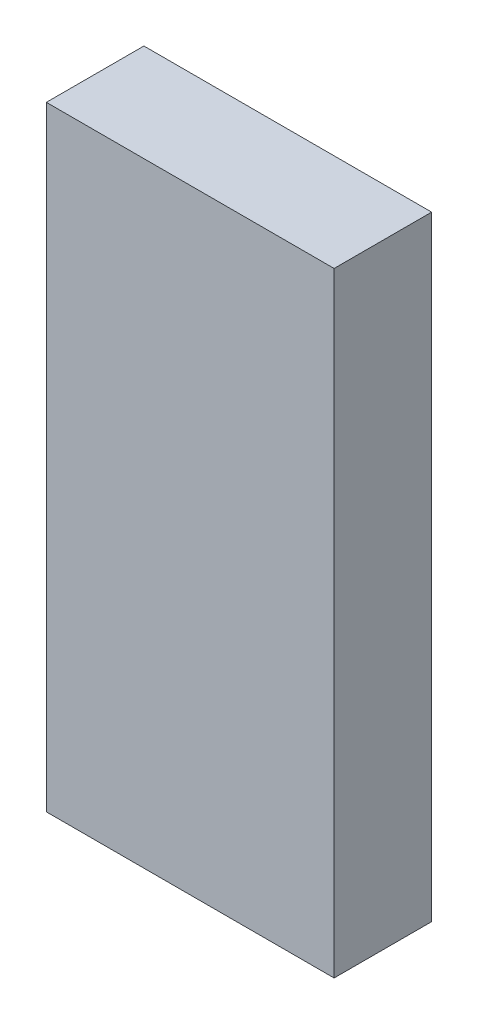
ISO-10303-21;
HEADER;
FILE_DESCRIPTION(('STEP AP214'),'2;1');
FILE_NAME('part.step','',(''),(''),'','','');
FILE_SCHEMA(('AUTOMOTIVE_DESIGN { 1 0 10303 214 1 1 1 1 }'));
ENDSEC;
DATA;
#1=APPLICATION_CONTEXT('core data for automotive mechanical design processes');
#2=APPLICATION_PROTOCOL_DEFINITION('international standard','automotive_design',2000,#1);
#3=PRODUCT_CONTEXT('',#1,'mechanical');
#4=PRODUCT('Part','Part','',(#3));
#5=PRODUCT_RELATED_PRODUCT_CATEGORY('part','',(#4));
#6=PRODUCT_DEFINITION_FORMATION('','',#4);
#7=PRODUCT_DEFINITION_CONTEXT('part definition',#1,'design');
#8=PRODUCT_DEFINITION('design','',#6,#7);
#9=PRODUCT_DEFINITION_SHAPE('','',#8);
#10=(LENGTH_UNIT() NAMED_UNIT(*) SI_UNIT(.MILLI.,.METRE.));
#11=(NAMED_UNIT(*) PLANE_ANGLE_UNIT() SI_UNIT($,.RADIAN.));
#12=(NAMED_UNIT(*) SI_UNIT($,.STERADIAN.) SOLID_ANGLE_UNIT());
#13=UNCERTAINTY_MEASURE_WITH_UNIT(LENGTH_MEASURE(1.E-05),#10,'distance_accuracy_value','');
#14=(GEOMETRIC_REPRESENTATION_CONTEXT(3) GLOBAL_UNCERTAINTY_ASSIGNED_CONTEXT((#13)) GLOBAL_UNIT_ASSIGNED_CONTEXT((#10,
#11,#12)) REPRESENTATION_CONTEXT('',''));
#15=CARTESIAN_POINT('',(0.,0.,0.));
#16=DIRECTION('',(0.,0.,1.));
#17=DIRECTION('',(1.,0.,0.));
#18=AXIS2_PLACEMENT_3D('',#15,#16,#17);
#19=CARTESIAN_POINT('',(2.95000172,-6.3000001,2.));
#20=DIRECTION('',(0.,0.,1.));
#21=DIRECTION('',(1.,0.,0.));
#22=AXIS2_PLACEMENT_3D('',#19,#20,#21);
#23=PLANE('',#22);
#24=DIRECTION('',(0.,1.,0.));
#25=VECTOR('',#24,1.);
#26=CARTESIAN_POINT('',(-2.94999918,-6.3000001,2.));
#27=LINE('',#26,#25);
#28=CARTESIAN_POINT('',(-2.94999918,-6.3000001,2.));
#29=VERTEX_POINT('',#28);
#30=CARTESIAN_POINT('',(-2.94999918,6.3000001,2.));
#31=VERTEX_POINT('',#30);
#32=EDGE_CURVE('E53',#29,#31,#27,.T.);
#33=ORIENTED_EDGE('',*,*,#32,.F.);
#34=DIRECTION('',(1.,0.,0.));
#35=VECTOR('',#34,1.);
#36=CARTESIAN_POINT('',(2.95000172,-6.3000001,2.));
#37=LINE('',#36,#35);
#38=CARTESIAN_POINT('',(2.95000172,-6.3000001,2.));
#39=VERTEX_POINT('',#38);
#40=EDGE_CURVE('E68',#39,#29,#37,.F.);
#41=ORIENTED_EDGE('',*,*,#40,.F.);
#42=DIRECTION('',(0.,1.,0.));
#43=VECTOR('',#42,1.);
#44=CARTESIAN_POINT('',(2.95000172,6.3000001,2.));
#45=LINE('',#44,#43);
#46=CARTESIAN_POINT('',(2.95000172,6.3000001,2.));
#47=VERTEX_POINT('',#46);
#48=EDGE_CURVE('E20',#47,#39,#45,.F.);
#49=ORIENTED_EDGE('',*,*,#48,.F.);
#50=DIRECTION('',(1.,0.,0.));
#51=VECTOR('',#50,1.);
#52=CARTESIAN_POINT('',(-2.94999918,6.3000001,2.));
#53=LINE('',#52,#51);
#54=EDGE_CURVE('E58',#31,#47,#53,.T.);
#55=ORIENTED_EDGE('',*,*,#54,.F.);
#56=EDGE_LOOP('',(#33,#41,#49,#55));
#57=FACE_BOUND('',#56,.T.);
#58=ADVANCED_FACE('F17',(#57),#23,.T.);
#59=CARTESIAN_POINT('',(2.95000172,6.3000001,0.));
#60=DIRECTION('',(1.,0.,0.));
#61=DIRECTION('',(0.,0.,-1.));
#62=AXIS2_PLACEMENT_3D('',#59,#60,#61);
#63=PLANE('',#62);
#64=DIRECTION('',(0.,0.,-1.));
#65=VECTOR('',#64,1.);
#66=CARTESIAN_POINT('',(2.95000172,-6.3000001,0.));
#67=LINE('',#66,#65);
#68=CARTESIAN_POINT('',(2.95000172,-6.3000001,0.));
#69=VERTEX_POINT('',#68);
#70=EDGE_CURVE('E79',#69,#39,#67,.F.);
#71=ORIENTED_EDGE('',*,*,#70,.F.);
#72=DIRECTION('',(0.,1.,0.));
#73=VECTOR('',#72,1.);
#74=CARTESIAN_POINT('',(2.95000172,-6.3000001,0.));
#75=LINE('',#74,#73);
#76=CARTESIAN_POINT('',(2.95000172,6.3000001,0.));
#77=VERTEX_POINT('',#76);
#78=EDGE_CURVE('E74',#69,#77,#75,.T.);
#79=ORIENTED_EDGE('',*,*,#78,.T.);
#80=DIRECTION('',(0.,0.,1.));
#81=VECTOR('',#80,1.);
#82=CARTESIAN_POINT('',(2.95000172,6.3000001,0.));
#83=LINE('',#82,#81);
#84=EDGE_CURVE('E63',#47,#77,#83,.F.);
#85=ORIENTED_EDGE('',*,*,#84,.F.);
#86=ORIENTED_EDGE('',*,*,#48,.T.);
#87=EDGE_LOOP('',(#71,#79,#85,#86));
#88=FACE_BOUND('',#87,.T.);
#89=ADVANCED_FACE('F73',(#88),#63,.T.);
#90=CARTESIAN_POINT('',(-2.94999918,6.3000001,0.));
#91=DIRECTION('',(0.,1.,0.));
#92=DIRECTION('',(0.,0.,1.));
#93=AXIS2_PLACEMENT_3D('',#90,#91,#92);
#94=PLANE('',#93);
#95=ORIENTED_EDGE('',*,*,#84,.T.);
#96=DIRECTION('',(1.,0.,0.));
#97=VECTOR('',#96,1.);
#98=CARTESIAN_POINT('',(2.95000172,6.3000001,0.));
#99=LINE('',#98,#97);
#100=CARTESIAN_POINT('',(-2.94999918,6.3000001,0.));
#101=VERTEX_POINT('',#100);
#102=EDGE_CURVE('E84',#77,#101,#99,.F.);
#103=ORIENTED_EDGE('',*,*,#102,.T.);
#104=DIRECTION('',(0.,0.,1.));
#105=VECTOR('',#104,1.);
#106=CARTESIAN_POINT('',(-2.94999918,6.3000001,0.));
#107=LINE('',#106,#105);
#108=EDGE_CURVE('E65',#31,#101,#107,.F.);
#109=ORIENTED_EDGE('',*,*,#108,.F.);
#110=ORIENTED_EDGE('',*,*,#54,.T.);
#111=EDGE_LOOP('',(#95,#103,#109,#110));
#112=FACE_BOUND('',#111,.T.);
#113=ADVANCED_FACE('F60',(#112),#94,.T.);
#114=CARTESIAN_POINT('',(-2.94999918,-6.3000001,0.));
#115=DIRECTION('',(-1.,0.,0.));
#116=DIRECTION('',(0.,0.,1.));
#117=AXIS2_PLACEMENT_3D('',#114,#115,#116);
#118=PLANE('',#117);
#119=ORIENTED_EDGE('',*,*,#108,.T.);
#120=DIRECTION('',(0.,1.,0.));
#121=VECTOR('',#120,1.);
#122=CARTESIAN_POINT('',(-2.94999918,-6.3000001,0.));
#123=LINE('',#122,#121);
#124=CARTESIAN_POINT('',(-2.94999918,-6.3000001,0.));
#125=VERTEX_POINT('',#124);
#126=EDGE_CURVE('E26',#101,#125,#123,.F.);
#127=ORIENTED_EDGE('',*,*,#126,.T.);
#128=DIRECTION('',(0.,0.,-1.));
#129=VECTOR('',#128,1.);
#130=CARTESIAN_POINT('',(-2.94999918,-6.3000001,0.));
#131=LINE('',#130,#129);
#132=EDGE_CURVE('E34',#29,#125,#131,.T.);
#133=ORIENTED_EDGE('',*,*,#132,.F.);
#134=ORIENTED_EDGE('',*,*,#32,.T.);
#135=EDGE_LOOP('',(#119,#127,#133,#134));
#136=FACE_BOUND('',#135,.T.);
#137=ADVANCED_FACE('F88',(#136),#118,.T.);
#138=CARTESIAN_POINT('',(2.95000172,-6.3000001,0.));
#139=DIRECTION('',(0.,-1.,0.));
#140=DIRECTION('',(0.,0.,-1.));
#141=AXIS2_PLACEMENT_3D('',#138,#139,#140);
#142=PLANE('',#141);
#143=ORIENTED_EDGE('',*,*,#132,.T.);
#144=DIRECTION('',(1.,0.,0.));
#145=VECTOR('',#144,1.);
#146=CARTESIAN_POINT('',(2.95000172,-6.3000001,0.));
#147=LINE('',#146,#145);
#148=EDGE_CURVE('E11',#125,#69,#147,.T.);
#149=ORIENTED_EDGE('',*,*,#148,.T.);
#150=ORIENTED_EDGE('',*,*,#70,.T.);
#151=ORIENTED_EDGE('',*,*,#40,.T.);
#152=EDGE_LOOP('',(#143,#149,#150,#151));
#153=FACE_BOUND('',#152,.T.);
#154=ADVANCED_FACE('F91',(#153),#142,.T.);
#155=CARTESIAN_POINT('',(2.95000172,-6.3000001,0.));
#156=DIRECTION('',(0.,0.,1.));
#157=DIRECTION('',(1.,0.,0.));
#158=AXIS2_PLACEMENT_3D('',#155,#156,#157);
#159=PLANE('',#158);
#160=ORIENTED_EDGE('',*,*,#126,.F.);
#161=ORIENTED_EDGE('',*,*,#102,.F.);
#162=ORIENTED_EDGE('',*,*,#78,.F.);
#163=ORIENTED_EDGE('',*,*,#148,.F.);
#164=EDGE_LOOP('',(#160,#161,#162,#163));
#165=FACE_BOUND('',#164,.T.);
#166=ADVANCED_FACE('F90',(#165),#159,.F.);
#167=CLOSED_SHELL('',(#58,#89,#113,#137,#154,#166));
#168=MANIFOLD_SOLID_BREP('B1',#167);
#169=ADVANCED_BREP_SHAPE_REPRESENTATION('',(#18,#168),#14);
#170=SHAPE_DEFINITION_REPRESENTATION(#9,#169);
ENDSEC;
END-ISO-10303-21;
